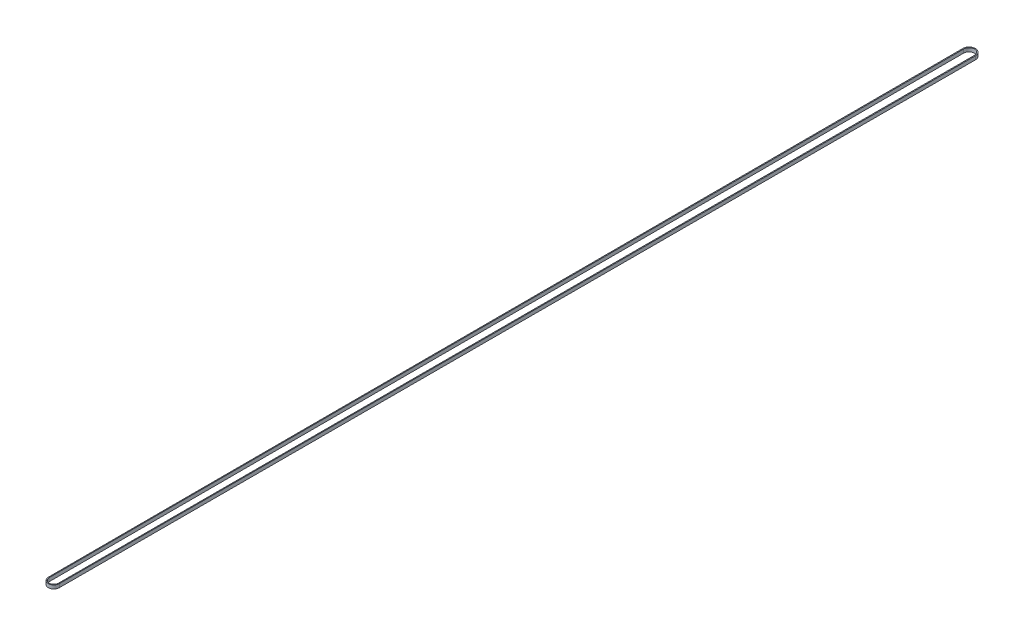
ISO-10303-21;
HEADER;
FILE_DESCRIPTION(('STEP AP214'),'2;1');
FILE_NAME('part.step','',(''),(''),'','','');
FILE_SCHEMA(('AUTOMOTIVE_DESIGN { 1 0 10303 214 1 1 1 1 }'));
ENDSEC;
DATA;
#1=APPLICATION_CONTEXT('core data for automotive mechanical design processes');
#2=APPLICATION_PROTOCOL_DEFINITION('international standard','automotive_design',2000,#1);
#3=PRODUCT_CONTEXT('',#1,'mechanical');
#4=PRODUCT('Part','Part','',(#3));
#5=PRODUCT_RELATED_PRODUCT_CATEGORY('part','',(#4));
#6=PRODUCT_DEFINITION_FORMATION('','',#4);
#7=PRODUCT_DEFINITION_CONTEXT('part definition',#1,'design');
#8=PRODUCT_DEFINITION('design','',#6,#7);
#9=PRODUCT_DEFINITION_SHAPE('','',#8);
#10=(LENGTH_UNIT() NAMED_UNIT(*) SI_UNIT(.MILLI.,.METRE.));
#11=(NAMED_UNIT(*) PLANE_ANGLE_UNIT() SI_UNIT($,.RADIAN.));
#12=(NAMED_UNIT(*) SI_UNIT($,.STERADIAN.) SOLID_ANGLE_UNIT());
#13=UNCERTAINTY_MEASURE_WITH_UNIT(LENGTH_MEASURE(1.E-05),#10,'distance_accuracy_value','');
#14=(GEOMETRIC_REPRESENTATION_CONTEXT(3) GLOBAL_UNCERTAINTY_ASSIGNED_CONTEXT((#13)) GLOBAL_UNIT_ASSIGNED_CONTEXT((#10,
#11,#12)) REPRESENTATION_CONTEXT('',''));
#15=CARTESIAN_POINT('',(0.,0.,0.));
#16=DIRECTION('',(0.,0.,1.));
#17=DIRECTION('',(1.,0.,0.));
#18=AXIS2_PLACEMENT_3D('',#15,#16,#17);
#19=CARTESIAN_POINT('',(1422.8552910795,-900.596288414722,-1.00989851158816));
#20=DIRECTION('',(-0.999999748114111,0.,0.000709768775174083));
#21=DIRECTION('',(0.000709768775174083,0.,0.999999748114111));
#22=AXIS2_PLACEMENT_3D('',#19,#20,#21);
#23=PLANE('',#22);
#24=DIRECTION('',(0.,1.,0.));
#25=VECTOR('',#24,1.);
#26=CARTESIAN_POINT('',(1423.51158841421,-900.596288414719,923.653445888986));
#27=LINE('',#26,#25);
#28=CARTESIAN_POINT('',(1423.51158841421,-900.596288414719,923.653445888986));
#29=VERTEX_POINT('',#28);
#30=CARTESIAN_POINT('',(1423.51158841421,-894.596288414719,923.653445888986));
#31=VERTEX_POINT('',#30);
#32=EDGE_CURVE('E158',#29,#31,#27,.T.);
#33=ORIENTED_EDGE('',*,*,#32,.T.);
#34=DIRECTION('',(0.000709768775174083,0.,0.999999748114111));
#35=VECTOR('',#34,1.);
#36=CARTESIAN_POINT('',(1422.8552910795,-894.596288414722,-1.00989851158818));
#37=LINE('',#36,#35);
#38=CARTESIAN_POINT('',(1422.41158841359,-894.596288414724,-626.146660889429));
#39=VERTEX_POINT('',#38);
#40=EDGE_CURVE('E128',#39,#31,#37,.T.);
#41=ORIENTED_EDGE('',*,*,#40,.F.);
#42=DIRECTION('',(0.,1.,0.));
#43=VECTOR('',#42,1.);
#44=CARTESIAN_POINT('',(1422.41158841359,-900.596288414724,-626.146660889429));
#45=LINE('',#44,#43);
#46=CARTESIAN_POINT('',(1422.41158841359,-900.596288414724,-626.146660889429));
#47=VERTEX_POINT('',#46);
#48=EDGE_CURVE('E11',#47,#39,#45,.T.);
#49=ORIENTED_EDGE('',*,*,#48,.F.);
#50=DIRECTION('',(0.000709768775174083,0.,0.999999748114111));
#51=VECTOR('',#50,1.);
#52=CARTESIAN_POINT('',(1422.8552910795,-900.596288414722,-1.00989851158816));
#53=LINE('',#52,#51);
#54=EDGE_CURVE('E147',#47,#29,#53,.T.);
#55=ORIENTED_EDGE('',*,*,#54,.T.);
#56=EDGE_LOOP('',(#33,#41,#49,#55));
#57=FACE_BOUND('',#56,.T.);
#58=ADVANCED_FACE('F33',(#57),#23,.T.);
#59=CARTESIAN_POINT('',(1433.16158841358,-900.596288414724,-626.146660889431));
#60=DIRECTION('',(0.,1.,0.));
#61=DIRECTION('',(-1.,0.,0.));
#62=AXIS2_PLACEMENT_3D('',#59,#60,#61);
#63=CYLINDRICAL_SURFACE('',#62,10.7499999999979);
#64=ORIENTED_EDGE('',*,*,#48,.T.);
#65=CARTESIAN_POINT('',(1433.16158841358,-894.596288414724,-626.146660889431));
#66=DIRECTION('',(0.,1.,0.));
#67=DIRECTION('',(-1.,0.,0.));
#68=AXIS2_PLACEMENT_3D('',#65,#66,#67);
#69=CIRCLE('',#68,10.7499999999979);
#70=CARTESIAN_POINT('',(1443.91159414246,-894.596288414724,-626.146660883514));
#71=VERTEX_POINT('',#70);
#72=EDGE_CURVE('E137',#71,#39,#69,.T.);
#73=ORIENTED_EDGE('',*,*,#72,.F.);
#74=DIRECTION('',(0.,1.,0.));
#75=VECTOR('',#74,1.);
#76=CARTESIAN_POINT('',(1443.91159414246,-900.596288414724,-626.146660883514));
#77=LINE('',#76,#75);
#78=CARTESIAN_POINT('',(1443.91159414246,-900.596288414724,-626.146660883514));
#79=VERTEX_POINT('',#78);
#80=EDGE_CURVE('E42',#79,#71,#77,.T.);
#81=ORIENTED_EDGE('',*,*,#80,.F.);
#82=CARTESIAN_POINT('',(1433.16158841358,-900.596288414724,-626.146660889431));
#83=DIRECTION('',(0.,1.,0.));
#84=DIRECTION('',(-1.,0.,0.));
#85=AXIS2_PLACEMENT_3D('',#82,#83,#84);
#86=CIRCLE('',#85,10.7499999999979);
#87=EDGE_CURVE('E110',#79,#47,#86,.T.);
#88=ORIENTED_EDGE('',*,*,#87,.T.);
#89=EDGE_LOOP('',(#64,#73,#81,#88));
#90=FACE_BOUND('',#89,.T.);
#91=ADVANCED_FACE('F178',(#90),#63,.T.);
#92=CARTESIAN_POINT('',(1443.2636251903,-900.596288414722,1.49001811110527));
#93=DIRECTION('',(0.999999467080736,0.,0.00103239442264691));
#94=DIRECTION('',(0.00103239442264691,0.,-0.999999467080736));
#95=AXIS2_PLACEMENT_3D('',#92,#93,#94);
#96=PLANE('',#95);
#97=ORIENTED_EDGE('',*,*,#80,.T.);
#98=DIRECTION('',(0.00103239442264691,0.,-0.999999467080736));
#99=VECTOR('',#98,1.);
#100=CARTESIAN_POINT('',(1443.2636251903,-894.596288414722,1.49001811110526));
#101=LINE('',#100,#99);
#102=CARTESIAN_POINT('',(1442.31158841357,-894.596288414719,923.65333911059));
#103=VERTEX_POINT('',#102);
#104=EDGE_CURVE('E134',#103,#71,#101,.T.);
#105=ORIENTED_EDGE('',*,*,#104,.F.);
#106=DIRECTION('',(0.,1.,0.));
#107=VECTOR('',#106,1.);
#108=CARTESIAN_POINT('',(1442.31158841357,-900.596288414719,923.65333911059));
#109=LINE('',#108,#107);
#110=CARTESIAN_POINT('',(1442.31158841357,-900.596288414719,923.65333911059));
#111=VERTEX_POINT('',#110);
#112=EDGE_CURVE('E156',#111,#103,#109,.T.);
#113=ORIENTED_EDGE('',*,*,#112,.F.);
#114=DIRECTION('',(0.00103239442264691,0.,-0.999999467080736));
#115=VECTOR('',#114,1.);
#116=CARTESIAN_POINT('',(1443.2636251903,-900.596288414722,1.49001811110527));
#117=LINE('',#116,#115);
#118=EDGE_CURVE('E152',#111,#79,#117,.T.);
#119=ORIENTED_EDGE('',*,*,#118,.T.);
#120=EDGE_LOOP('',(#97,#105,#113,#119));
#121=FACE_BOUND('',#120,.T.);
#122=ADVANCED_FACE('F183',(#121),#96,.T.);
#123=CARTESIAN_POINT('',(1432.91158841359,-900.596288414719,923.65333911059));
#124=DIRECTION('',(0.,1.,0.));
#125=DIRECTION('',(-1.,0.,0.));
#126=AXIS2_PLACEMENT_3D('',#123,#124,#125);
#127=CYLINDRICAL_SURFACE('',#126,8.00000000000001);
#128=DIRECTION('',(0.,1.,0.));
#129=VECTOR('',#128,1.);
#130=CARTESIAN_POINT('',(1424.91158841359,-900.596288414719,923.653339110592));
#131=LINE('',#130,#129);
#132=CARTESIAN_POINT('',(1424.91158841359,-900.596288414719,923.653339110592));
#133=VERTEX_POINT('',#132);
#134=CARTESIAN_POINT('',(1424.91158841359,-894.596288414719,923.653339110592));
#135=VERTEX_POINT('',#134);
#136=EDGE_CURVE('E37',#133,#135,#131,.T.);
#137=ORIENTED_EDGE('',*,*,#136,.T.);
#138=CARTESIAN_POINT('',(1432.91158841359,-894.596288414719,923.65333911059));
#139=DIRECTION('',(0.,1.,0.));
#140=DIRECTION('',(-1.,0.,0.));
#141=AXIS2_PLACEMENT_3D('',#138,#139,#140);
#142=CIRCLE('',#141,8.00000000000001);
#143=CARTESIAN_POINT('',(1440.91158841359,-894.596288414719,923.65333911059));
#144=VERTEX_POINT('',#143);
#145=EDGE_CURVE('E102',#135,#144,#142,.T.);
#146=ORIENTED_EDGE('',*,*,#145,.T.);
#147=DIRECTION('',(0.,1.,0.));
#148=VECTOR('',#147,1.);
#149=CARTESIAN_POINT('',(1440.91158841359,-900.596288414719,923.65333911059));
#150=LINE('',#149,#148);
#151=CARTESIAN_POINT('',(1440.91158841359,-900.596288414719,923.65333911059));
#152=VERTEX_POINT('',#151);
#153=EDGE_CURVE('E160',#152,#144,#150,.T.);
#154=ORIENTED_EDGE('',*,*,#153,.F.);
#155=CARTESIAN_POINT('',(1432.91158841359,-900.596288414719,923.65333911059));
#156=DIRECTION('',(0.,1.,0.));
#157=DIRECTION('',(-1.,0.,0.));
#158=AXIS2_PLACEMENT_3D('',#155,#156,#157);
#159=CIRCLE('',#158,8.00000000000001);
#160=EDGE_CURVE('E105',#133,#152,#159,.T.);
#161=ORIENTED_EDGE('',*,*,#160,.F.);
#162=EDGE_LOOP('',(#137,#146,#154,#161));
#163=FACE_BOUND('',#162,.T.);
#164=ADVANCED_FACE('F35',(#163),#127,.F.);
#165=CARTESIAN_POINT('',(1441.7447871037,-900.596288414722,1.30238914822382));
#166=DIRECTION('',(0.999999591986534,0.,0.000903341998175387));
#167=DIRECTION('',(0.000903341998175387,0.,-0.999999591986534));
#168=AXIS2_PLACEMENT_3D('',#165,#166,#167);
#169=PLANE('',#168);
#170=ORIENTED_EDGE('',*,*,#153,.T.);
#171=DIRECTION('',(0.000903341998175387,0.,-0.999999591986534));
#172=VECTOR('',#171,1.);
#173=CARTESIAN_POINT('',(1441.7447871037,-894.596288414722,1.3023891482238));
#174=LINE('',#173,#172);
#175=CARTESIAN_POINT('',(1442.31158841358,-894.596288414724,-626.146660889431));
#176=VERTEX_POINT('',#175);
#177=EDGE_CURVE('E123',#144,#176,#174,.T.);
#178=ORIENTED_EDGE('',*,*,#177,.T.);
#179=DIRECTION('',(0.,1.,0.));
#180=VECTOR('',#179,1.);
#181=CARTESIAN_POINT('',(1442.31158841358,-900.596288414724,-626.146660889431));
#182=LINE('',#181,#180);
#183=CARTESIAN_POINT('',(1442.31158841358,-900.596288414724,-626.146660889431));
#184=VERTEX_POINT('',#183);
#185=EDGE_CURVE('E162',#184,#176,#182,.T.);
#186=ORIENTED_EDGE('',*,*,#185,.F.);
#187=DIRECTION('',(0.000903341998175387,0.,-0.999999591986534));
#188=VECTOR('',#187,1.);
#189=CARTESIAN_POINT('',(1441.7447871037,-900.596288414722,1.30238914822382));
#190=LINE('',#189,#188);
#191=EDGE_CURVE('E145',#152,#184,#190,.T.);
#192=ORIENTED_EDGE('',*,*,#191,.F.);
#193=EDGE_LOOP('',(#170,#178,#186,#192));
#194=FACE_BOUND('',#193,.T.);
#195=ADVANCED_FACE('F168',(#194),#169,.F.);
#196=CARTESIAN_POINT('',(1433.16158841358,-900.596288414724,-626.146660889431));
#197=DIRECTION('',(0.,1.,0.));
#198=DIRECTION('',(-1.,0.,0.));
#199=AXIS2_PLACEMENT_3D('',#196,#197,#198);
#200=CYLINDRICAL_SURFACE('',#199,9.14999736191219);
#201=ORIENTED_EDGE('',*,*,#185,.T.);
#202=CARTESIAN_POINT('',(1433.16158841358,-894.596288414724,-626.146660889431));
#203=DIRECTION('',(0.,1.,0.));
#204=DIRECTION('',(-1.,0.,0.));
#205=AXIS2_PLACEMENT_3D('',#202,#203,#204);
#206=CIRCLE('',#205,9.14999736191219);
#207=CARTESIAN_POINT('',(1424.01158841358,-894.596288414724,-626.146660889429));
#208=VERTEX_POINT('',#207);
#209=EDGE_CURVE('E118',#176,#208,#206,.T.);
#210=ORIENTED_EDGE('',*,*,#209,.T.);
#211=DIRECTION('',(0.,1.,0.));
#212=VECTOR('',#211,1.);
#213=CARTESIAN_POINT('',(1424.01158841358,-900.596288414724,-626.146660889429));
#214=LINE('',#213,#212);
#215=CARTESIAN_POINT('',(1424.01158841358,-900.596288414724,-626.146660889429));
#216=VERTEX_POINT('',#215);
#217=EDGE_CURVE('E109',#216,#208,#214,.T.);
#218=ORIENTED_EDGE('',*,*,#217,.F.);
#219=CARTESIAN_POINT('',(1433.16158841358,-900.596288414724,-626.146660889431));
#220=DIRECTION('',(0.,1.,0.));
#221=DIRECTION('',(-1.,0.,0.));
#222=AXIS2_PLACEMENT_3D('',#219,#220,#221);
#223=CIRCLE('',#222,9.14999736191219);
#224=EDGE_CURVE('E143',#184,#216,#223,.T.);
#225=ORIENTED_EDGE('',*,*,#224,.F.);
#226=EDGE_LOOP('',(#201,#210,#218,#225));
#227=FACE_BOUND('',#226,.T.);
#228=ADVANCED_FACE('F166',(#227),#200,.F.);
#229=CARTESIAN_POINT('',(1424.37472401049,-900.596288414722,-0.82716302209216));
#230=DIRECTION('',(0.999999831382129,0.,-0.00058071999500187));
#231=DIRECTION('',(-0.00058071999500187,0.,-0.99999983138213));
#232=AXIS2_PLACEMENT_3D('',#229,#230,#231);
#233=PLANE('',#232);
#234=ORIENTED_EDGE('',*,*,#217,.T.);
#235=DIRECTION('',(-0.00058071999500187,0.,-0.99999983138213));
#236=VECTOR('',#235,1.);
#237=CARTESIAN_POINT('',(1424.37472401049,-894.596288414722,-0.827163022092178));
#238=LINE('',#237,#236);
#239=EDGE_CURVE('E112',#135,#208,#238,.T.);
#240=ORIENTED_EDGE('',*,*,#239,.F.);
#241=ORIENTED_EDGE('',*,*,#136,.F.);
#242=DIRECTION('',(-0.00058071999500187,0.,-0.99999983138213));
#243=VECTOR('',#242,1.);
#244=CARTESIAN_POINT('',(1424.37472401049,-900.596288414722,-0.82716302209216));
#245=LINE('',#244,#243);
#246=EDGE_CURVE('E141',#133,#216,#245,.T.);
#247=ORIENTED_EDGE('',*,*,#246,.T.);
#248=EDGE_LOOP('',(#234,#240,#241,#247));
#249=FACE_BOUND('',#248,.T.);
#250=ADVANCED_FACE('F113',(#249),#233,.T.);
#251=CARTESIAN_POINT('',(1432.91158841359,-900.596288414719,923.65333911059));
#252=DIRECTION('',(0.,1.,0.));
#253=DIRECTION('',(-1.,0.,0.));
#254=AXIS2_PLACEMENT_3D('',#251,#252,#253);
#255=CYLINDRICAL_SURFACE('',#254,9.39999999998401);
#256=ORIENTED_EDGE('',*,*,#112,.T.);
#257=CARTESIAN_POINT('',(1432.91158841359,-894.596288414719,923.65333911059));
#258=DIRECTION('',(0.,1.,0.));
#259=DIRECTION('',(-1.,0.,0.));
#260=AXIS2_PLACEMENT_3D('',#257,#258,#259);
#261=CIRCLE('',#260,9.39999999998401);
#262=EDGE_CURVE('E131',#31,#103,#261,.T.);
#263=ORIENTED_EDGE('',*,*,#262,.F.);
#264=ORIENTED_EDGE('',*,*,#32,.F.);
#265=CARTESIAN_POINT('',(1432.91158841359,-900.596288414719,923.65333911059));
#266=DIRECTION('',(0.,1.,0.));
#267=DIRECTION('',(-1.,0.,0.));
#268=AXIS2_PLACEMENT_3D('',#265,#266,#267);
#269=CIRCLE('',#268,9.39999999998401);
#270=EDGE_CURVE('E149',#29,#111,#269,.T.);
#271=ORIENTED_EDGE('',*,*,#270,.T.);
#272=EDGE_LOOP('',(#256,#263,#264,#271));
#273=FACE_BOUND('',#272,.T.);
#274=ADVANCED_FACE('F173',(#273),#255,.T.);
#275=CARTESIAN_POINT('',(3.02901928603392E-12,-900.596288414727,3.74771246230212E-12));
#276=DIRECTION('',(0.,1.,0.));
#277=DIRECTION('',(-1.,0.,0.));
#278=AXIS2_PLACEMENT_3D('',#275,#276,#277);
#279=PLANE('',#278);
#280=ORIENTED_EDGE('',*,*,#160,.T.);
#281=ORIENTED_EDGE('',*,*,#191,.T.);
#282=ORIENTED_EDGE('',*,*,#224,.T.);
#283=ORIENTED_EDGE('',*,*,#246,.F.);
#284=EDGE_LOOP('',(#280,#281,#282,#283));
#285=FACE_BOUND('',#284,.T.);
#286=ORIENTED_EDGE('',*,*,#54,.F.);
#287=ORIENTED_EDGE('',*,*,#87,.F.);
#288=ORIENTED_EDGE('',*,*,#118,.F.);
#289=ORIENTED_EDGE('',*,*,#270,.F.);
#290=EDGE_LOOP('',(#286,#287,#288,#289));
#291=FACE_BOUND('',#290,.T.);
#292=ADVANCED_FACE('F170',(#285,#291),#279,.F.);
#293=CARTESIAN_POINT('',(3.00863830314224E-12,-894.596288414727,3.72994272655803E-12));
#294=DIRECTION('',(0.,1.,0.));
#295=DIRECTION('',(-1.,0.,0.));
#296=AXIS2_PLACEMENT_3D('',#293,#294,#295);
#297=PLANE('',#296);
#298=ORIENTED_EDGE('',*,*,#145,.F.);
#299=ORIENTED_EDGE('',*,*,#239,.T.);
#300=ORIENTED_EDGE('',*,*,#209,.F.);
#301=ORIENTED_EDGE('',*,*,#177,.F.);
#302=EDGE_LOOP('',(#298,#299,#300,#301));
#303=FACE_BOUND('',#302,.T.);
#304=ORIENTED_EDGE('',*,*,#40,.T.);
#305=ORIENTED_EDGE('',*,*,#262,.T.);
#306=ORIENTED_EDGE('',*,*,#104,.T.);
#307=ORIENTED_EDGE('',*,*,#72,.T.);
#308=EDGE_LOOP('',(#304,#305,#306,#307));
#309=FACE_BOUND('',#308,.T.);
#310=ADVANCED_FACE('F120',(#303,#309),#297,.T.);
#311=CLOSED_SHELL('',(#58,#91,#122,#164,#195,#228,#250,#274,#292,#310));
#312=MANIFOLD_SOLID_BREP('B2',#311);
#313=ADVANCED_BREP_SHAPE_REPRESENTATION('',(#18,#312),#14);
#314=SHAPE_DEFINITION_REPRESENTATION(#9,#313);
ENDSEC;
END-ISO-10303-21;
